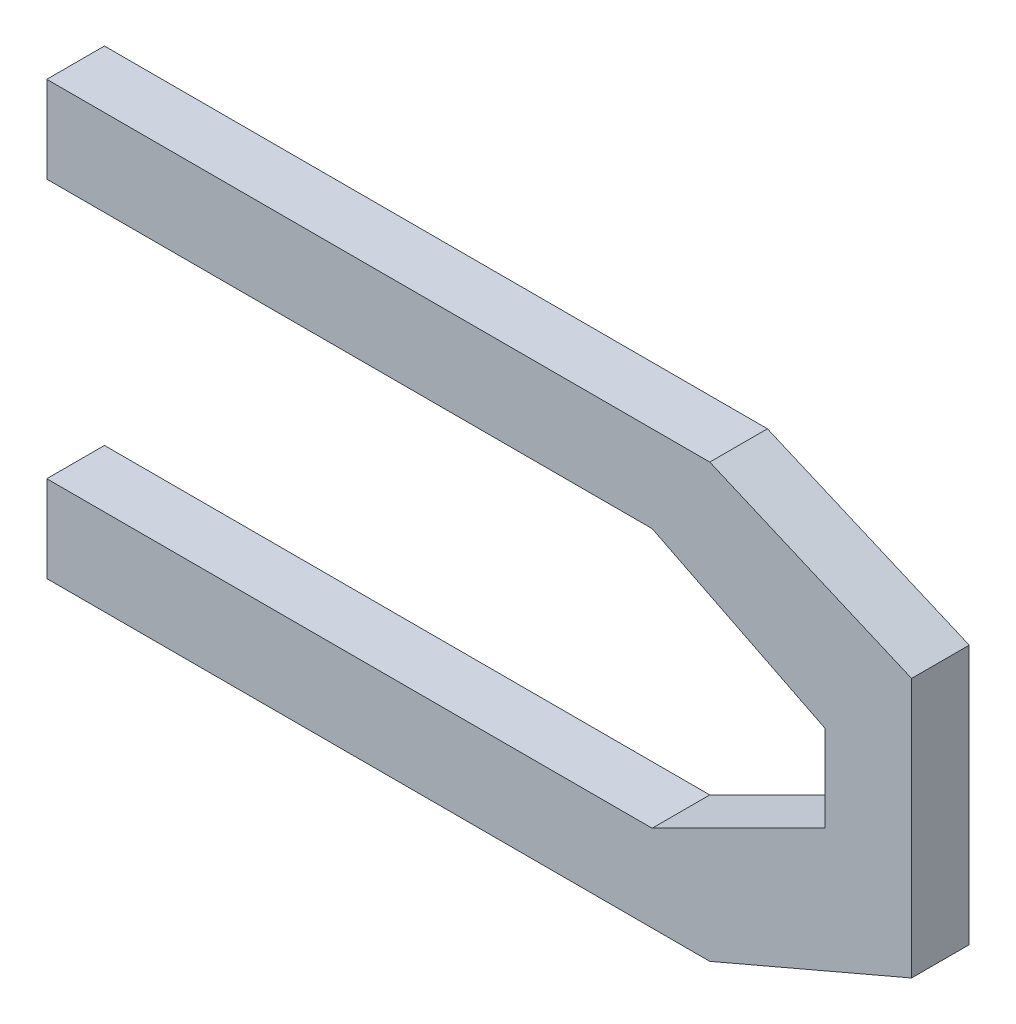
ISO-10303-21;
HEADER;
FILE_DESCRIPTION(('STEP AP214'),'2;1');
FILE_NAME('part.step','',(''),(''),'','','');
FILE_SCHEMA(('AUTOMOTIVE_DESIGN { 1 0 10303 214 1 1 1 1 }'));
ENDSEC;
DATA;
#1=APPLICATION_CONTEXT('core data for automotive mechanical design processes');
#2=APPLICATION_PROTOCOL_DEFINITION('international standard','automotive_design',2000,#1);
#3=PRODUCT_CONTEXT('',#1,'mechanical');
#4=PRODUCT('Part','Part','',(#3));
#5=PRODUCT_RELATED_PRODUCT_CATEGORY('part','',(#4));
#6=PRODUCT_DEFINITION_FORMATION('','',#4);
#7=PRODUCT_DEFINITION_CONTEXT('part definition',#1,'design');
#8=PRODUCT_DEFINITION('design','',#6,#7);
#9=PRODUCT_DEFINITION_SHAPE('','',#8);
#10=(LENGTH_UNIT() NAMED_UNIT(*) SI_UNIT(.MILLI.,.METRE.));
#11=(NAMED_UNIT(*) PLANE_ANGLE_UNIT() SI_UNIT($,.RADIAN.));
#12=(NAMED_UNIT(*) SI_UNIT($,.STERADIAN.) SOLID_ANGLE_UNIT());
#13=UNCERTAINTY_MEASURE_WITH_UNIT(LENGTH_MEASURE(1.E-05),#10,'distance_accuracy_value','');
#14=(GEOMETRIC_REPRESENTATION_CONTEXT(3) GLOBAL_UNCERTAINTY_ASSIGNED_CONTEXT((#13)) GLOBAL_UNIT_ASSIGNED_CONTEXT((#10,
#11,#12)) REPRESENTATION_CONTEXT('',''));
#15=CARTESIAN_POINT('',(0.,0.,0.));
#16=DIRECTION('',(0.,0.,1.));
#17=DIRECTION('',(1.,0.,0.));
#18=AXIS2_PLACEMENT_3D('',#15,#16,#17);
#19=CARTESIAN_POINT('',(-0.1905,-0.09525000000002,0.0254));
#20=DIRECTION('',(0.,0.,1.));
#21=DIRECTION('',(1.,0.,0.));
#22=AXIS2_PLACEMENT_3D('',#19,#20,#21);
#23=PLANE('',#22);
#24=DIRECTION('',(1.,0.,0.));
#25=VECTOR('',#24,1.);
#26=CARTESIAN_POINT('',(-0.1905,-0.05715000000001,0.0254));
#27=LINE('',#26,#25);
#28=CARTESIAN_POINT('',(-0.1905,-0.05715000000001,0.0254));
#29=VERTEX_POINT('',#28);
#30=CARTESIAN_POINT('',(0.0762,-0.05715000000001,0.0254));
#31=VERTEX_POINT('',#30);
#32=EDGE_CURVE('E157',#29,#31,#27,.T.);
#33=ORIENTED_EDGE('',*,*,#32,.F.);
#34=DIRECTION('',(0.,1.,0.));
#35=VECTOR('',#34,1.);
#36=CARTESIAN_POINT('',(-0.1905,-0.09525000000002,0.0254));
#37=LINE('',#36,#35);
#38=CARTESIAN_POINT('',(-0.1905,-0.09525000000002,0.0254));
#39=VERTEX_POINT('',#38);
#40=EDGE_CURVE('E118',#39,#29,#37,.T.);
#41=ORIENTED_EDGE('',*,*,#40,.F.);
#42=DIRECTION('',(1.,0.,0.));
#43=VECTOR('',#42,1.);
#44=CARTESIAN_POINT('',(0.1016,-0.09525000000002,0.0254));
#45=LINE('',#44,#43);
#46=CARTESIAN_POINT('',(0.101599999999998,-0.095250000000015,0.0254));
#47=VERTEX_POINT('',#46);
#48=EDGE_CURVE('E20',#47,#39,#45,.F.);
#49=ORIENTED_EDGE('',*,*,#48,.F.);
#50=DIRECTION('',(0.91914503001811,0.393919298579047,0.));
#51=VECTOR('',#50,1.);
#52=CARTESIAN_POINT('',(0.1905,-0.05715000000001,0.0254));
#53=LINE('',#52,#51);
#54=CARTESIAN_POINT('',(0.1905,-0.05715000000001,0.0254));
#55=VERTEX_POINT('',#54);
#56=EDGE_CURVE('E107',#55,#47,#53,.F.);
#57=ORIENTED_EDGE('',*,*,#56,.F.);
#58=DIRECTION('',(0.,1.,0.));
#59=VECTOR('',#58,1.);
#60=CARTESIAN_POINT('',(0.1905,0.05714999999998,0.0254));
#61=LINE('',#60,#59);
#62=CARTESIAN_POINT('',(0.190500000000002,0.057149999999985,0.0254));
#63=VERTEX_POINT('',#62);
#64=EDGE_CURVE('E102',#63,#55,#61,.F.);
#65=ORIENTED_EDGE('',*,*,#64,.F.);
#66=DIRECTION('',(-0.91914503001811,0.393919298579047,0.));
#67=VECTOR('',#66,1.);
#68=CARTESIAN_POINT('',(0.1016,0.09524999999999,0.0254));
#69=LINE('',#68,#67);
#70=CARTESIAN_POINT('',(0.1016,0.09524999999999,0.0254));
#71=VERTEX_POINT('',#70);
#72=EDGE_CURVE('E129',#71,#63,#69,.F.);
#73=ORIENTED_EDGE('',*,*,#72,.F.);
#74=DIRECTION('',(1.,0.,0.));
#75=VECTOR('',#74,1.);
#76=CARTESIAN_POINT('',(-0.1905,0.09524999999999,0.0254));
#77=LINE('',#76,#75);
#78=CARTESIAN_POINT('',(-0.1905,0.09524999999999,0.0254));
#79=VERTEX_POINT('',#78);
#80=EDGE_CURVE('E133',#79,#71,#77,.T.);
#81=ORIENTED_EDGE('',*,*,#80,.F.);
#82=DIRECTION('',(0.,1.,0.));
#83=VECTOR('',#82,1.);
#84=CARTESIAN_POINT('',(-0.1905,0.05714999999998,0.0254));
#85=LINE('',#84,#83);
#86=CARTESIAN_POINT('',(-0.1905,0.05714999999998,0.0254));
#87=VERTEX_POINT('',#86);
#88=EDGE_CURVE('E137',#87,#79,#85,.T.);
#89=ORIENTED_EDGE('',*,*,#88,.F.);
#90=DIRECTION('',(1.,0.,0.));
#91=VECTOR('',#90,1.);
#92=CARTESIAN_POINT('',(0.0762,0.05714999999998,0.0254));
#93=LINE('',#92,#91);
#94=CARTESIAN_POINT('',(0.076200000000001,0.057149999999982,0.0254));
#95=VERTEX_POINT('',#94);
#96=EDGE_CURVE('E141',#95,#87,#93,.F.);
#97=ORIENTED_EDGE('',*,*,#96,.F.);
#98=DIRECTION('',(0.894427190999916,-0.447213595499958,0.));
#99=VECTOR('',#98,1.);
#100=CARTESIAN_POINT('',(0.1524,0.01904999999999,0.0254));
#101=LINE('',#100,#99);
#102=CARTESIAN_POINT('',(0.1524,0.01904999999999,0.0254));
#103=VERTEX_POINT('',#102);
#104=EDGE_CURVE('E145',#103,#95,#101,.F.);
#105=ORIENTED_EDGE('',*,*,#104,.F.);
#106=DIRECTION('',(0.,1.,0.));
#107=VECTOR('',#106,1.);
#108=CARTESIAN_POINT('',(0.1524,-0.01905000000002,0.0254));
#109=LINE('',#108,#107);
#110=CARTESIAN_POINT('',(0.152399999999999,-0.019050000000018,0.0254));
#111=VERTEX_POINT('',#110);
#112=EDGE_CURVE('E149',#111,#103,#109,.T.);
#113=ORIENTED_EDGE('',*,*,#112,.F.);
#114=DIRECTION('',(-0.894427190999916,-0.447213595499958,0.));
#115=VECTOR('',#114,1.);
#116=CARTESIAN_POINT('',(0.0762,-0.05715000000001,0.0254));
#117=LINE('',#116,#115);
#118=EDGE_CURVE('E153',#31,#111,#117,.F.);
#119=ORIENTED_EDGE('',*,*,#118,.F.);
#120=EDGE_LOOP('',(#33,#41,#49,#57,#65,#73,#81,#89,#97,#105,#113,#119));
#121=FACE_BOUND('',#120,.T.);
#122=ADVANCED_FACE('F17',(#121),#23,.T.);
#123=CARTESIAN_POINT('',(0.1016,-0.09525000000002,0.));
#124=DIRECTION('',(0.,-1.,0.));
#125=DIRECTION('',(0.,0.,-1.));
#126=AXIS2_PLACEMENT_3D('',#123,#124,#125);
#127=PLANE('',#126);
#128=DIRECTION('',(0.,0.,1.));
#129=VECTOR('',#128,1.);
#130=CARTESIAN_POINT('',(-0.1905,-0.09525000000002,0.));
#131=LINE('',#130,#129);
#132=CARTESIAN_POINT('',(-0.1905,-0.09525000000002,0.));
#133=VERTEX_POINT('',#132);
#134=EDGE_CURVE('E161',#133,#39,#131,.T.);
#135=ORIENTED_EDGE('',*,*,#134,.F.);
#136=DIRECTION('',(1.,0.,0.));
#137=VECTOR('',#136,1.);
#138=CARTESIAN_POINT('',(-0.1905,-0.09525000000002,0.));
#139=LINE('',#138,#137);
#140=CARTESIAN_POINT('',(0.101599999999998,-0.095250000000015,0.));
#141=VERTEX_POINT('',#140);
#142=EDGE_CURVE('E124',#133,#141,#139,.T.);
#143=ORIENTED_EDGE('',*,*,#142,.T.);
#144=DIRECTION('',(0.,0.,1.));
#145=VECTOR('',#144,1.);
#146=CARTESIAN_POINT('',(0.101599999999991,-0.0952499999999999,0.));
#147=LINE('',#146,#145);
#148=EDGE_CURVE('E112',#47,#141,#147,.F.);
#149=ORIENTED_EDGE('',*,*,#148,.F.);
#150=ORIENTED_EDGE('',*,*,#48,.T.);
#151=EDGE_LOOP('',(#135,#143,#149,#150));
#152=FACE_BOUND('',#151,.T.);
#153=ADVANCED_FACE('F123',(#152),#127,.T.);
#154=CARTESIAN_POINT('',(0.1905,-0.05715000000001,0.));
#155=DIRECTION('',(0.393919298579047,-0.91914503001811,0.));
#156=DIRECTION('',(0.91914503001811,0.393919298579047,0.));
#157=AXIS2_PLACEMENT_3D('',#154,#155,#156);
#158=PLANE('',#157);
#159=ORIENTED_EDGE('',*,*,#148,.T.);
#160=DIRECTION('',(0.919145030018021,0.393919298579255,0.));
#161=VECTOR('',#160,1.);
#162=CARTESIAN_POINT('',(0.1016,-0.09525000000002,0.));
#163=LINE('',#162,#161);
#164=CARTESIAN_POINT('',(0.1905,-0.05715000000001,0.));
#165=VERTEX_POINT('',#164);
#166=EDGE_CURVE('E166',#141,#165,#163,.T.);
#167=ORIENTED_EDGE('',*,*,#166,.T.);
#168=DIRECTION('',(0.,0.,-1.));
#169=VECTOR('',#168,1.);
#170=CARTESIAN_POINT('',(0.1905,-0.05715000000001,0.));
#171=LINE('',#170,#169);
#172=EDGE_CURVE('E114',#55,#165,#171,.T.);
#173=ORIENTED_EDGE('',*,*,#172,.F.);
#174=ORIENTED_EDGE('',*,*,#56,.T.);
#175=EDGE_LOOP('',(#159,#167,#173,#174));
#176=FACE_BOUND('',#175,.T.);
#177=ADVANCED_FACE('F109',(#176),#158,.T.);
#178=CARTESIAN_POINT('',(0.1905,0.05714999999998,0.));
#179=DIRECTION('',(1.,0.,0.));
#180=DIRECTION('',(0.,0.,-1.));
#181=AXIS2_PLACEMENT_3D('',#178,#179,#180);
#182=PLANE('',#181);
#183=ORIENTED_EDGE('',*,*,#172,.T.);
#184=DIRECTION('',(0.,1.,0.));
#185=VECTOR('',#184,1.);
#186=CARTESIAN_POINT('',(0.1905,-0.09525000000002,0.));
#187=LINE('',#186,#185);
#188=CARTESIAN_POINT('',(0.190500000000002,0.057149999999985,0.));
#189=VERTEX_POINT('',#188);
#190=EDGE_CURVE('E168',#165,#189,#187,.T.);
#191=ORIENTED_EDGE('',*,*,#190,.T.);
#192=DIRECTION('',(0.,0.,1.));
#193=VECTOR('',#192,1.);
#194=CARTESIAN_POINT('',(0.190500000000009,0.0571500000000001,0.));
#195=LINE('',#194,#193);
#196=EDGE_CURVE('E131',#63,#189,#195,.F.);
#197=ORIENTED_EDGE('',*,*,#196,.F.);
#198=ORIENTED_EDGE('',*,*,#64,.T.);
#199=EDGE_LOOP('',(#183,#191,#197,#198));
#200=FACE_BOUND('',#199,.T.);
#201=ADVANCED_FACE('F234',(#200),#182,.T.);
#202=CARTESIAN_POINT('',(0.1016,0.09524999999999,0.));
#203=DIRECTION('',(0.393919298579047,0.91914503001811,0.));
#204=DIRECTION('',(-0.91914503001811,0.393919298579047,0.));
#205=AXIS2_PLACEMENT_3D('',#202,#203,#204);
#206=PLANE('',#205);
#207=ORIENTED_EDGE('',*,*,#196,.T.);
#208=DIRECTION('',(-0.919145030018021,0.393919298579255,0.));
#209=VECTOR('',#208,1.);
#210=CARTESIAN_POINT('',(0.1905,0.05714999999998,0.));
#211=LINE('',#210,#209);
#212=CARTESIAN_POINT('',(0.1016,0.09524999999999,0.));
#213=VERTEX_POINT('',#212);
#214=EDGE_CURVE('E171',#189,#213,#211,.T.);
#215=ORIENTED_EDGE('',*,*,#214,.T.);
#216=DIRECTION('',(0.,0.,1.));
#217=VECTOR('',#216,1.);
#218=CARTESIAN_POINT('',(0.1016,0.09524999999999,0.));
#219=LINE('',#218,#217);
#220=EDGE_CURVE('E135',#71,#213,#219,.F.);
#221=ORIENTED_EDGE('',*,*,#220,.F.);
#222=ORIENTED_EDGE('',*,*,#72,.T.);
#223=EDGE_LOOP('',(#207,#215,#221,#222));
#224=FACE_BOUND('',#223,.T.);
#225=ADVANCED_FACE('F233',(#224),#206,.T.);
#226=CARTESIAN_POINT('',(-0.1905,0.09524999999999,0.));
#227=DIRECTION('',(0.,1.,0.));
#228=DIRECTION('',(0.,0.,1.));
#229=AXIS2_PLACEMENT_3D('',#226,#227,#228);
#230=PLANE('',#229);
#231=ORIENTED_EDGE('',*,*,#220,.T.);
#232=DIRECTION('',(1.,0.,0.));
#233=VECTOR('',#232,1.);
#234=CARTESIAN_POINT('',(-0.1905,0.09524999999999,0.));
#235=LINE('',#234,#233);
#236=CARTESIAN_POINT('',(-0.1905,0.09524999999999,0.));
#237=VERTEX_POINT('',#236);
#238=EDGE_CURVE('E174',#213,#237,#235,.F.);
#239=ORIENTED_EDGE('',*,*,#238,.T.);
#240=DIRECTION('',(0.,0.,1.));
#241=VECTOR('',#240,1.);
#242=CARTESIAN_POINT('',(-0.1905,0.09524999999999,0.));
#243=LINE('',#242,#241);
#244=EDGE_CURVE('E139',#79,#237,#243,.F.);
#245=ORIENTED_EDGE('',*,*,#244,.F.);
#246=ORIENTED_EDGE('',*,*,#80,.T.);
#247=EDGE_LOOP('',(#231,#239,#245,#246));
#248=FACE_BOUND('',#247,.T.);
#249=ADVANCED_FACE('F227',(#248),#230,.T.);
#250=CARTESIAN_POINT('',(-0.1905,0.05714999999998,0.));
#251=DIRECTION('',(-1.,0.,0.));
#252=DIRECTION('',(0.,0.,1.));
#253=AXIS2_PLACEMENT_3D('',#250,#251,#252);
#254=PLANE('',#253);
#255=ORIENTED_EDGE('',*,*,#244,.T.);
#256=DIRECTION('',(0.,1.,0.));
#257=VECTOR('',#256,1.);
#258=CARTESIAN_POINT('',(-0.1905,-0.09525000000002,0.));
#259=LINE('',#258,#257);
#260=CARTESIAN_POINT('',(-0.1905,0.05714999999998,0.));
#261=VERTEX_POINT('',#260);
#262=EDGE_CURVE('E177',#237,#261,#259,.F.);
#263=ORIENTED_EDGE('',*,*,#262,.T.);
#264=DIRECTION('',(0.,0.,-1.));
#265=VECTOR('',#264,1.);
#266=CARTESIAN_POINT('',(-0.1905,0.05714999999998,0.));
#267=LINE('',#266,#265);
#268=EDGE_CURVE('E143',#87,#261,#267,.T.);
#269=ORIENTED_EDGE('',*,*,#268,.F.);
#270=ORIENTED_EDGE('',*,*,#88,.T.);
#271=EDGE_LOOP('',(#255,#263,#269,#270));
#272=FACE_BOUND('',#271,.T.);
#273=ADVANCED_FACE('F223',(#272),#254,.T.);
#274=CARTESIAN_POINT('',(0.0762,0.05714999999998,0.));
#275=DIRECTION('',(0.,-1.,0.));
#276=DIRECTION('',(0.,0.,-1.));
#277=AXIS2_PLACEMENT_3D('',#274,#275,#276);
#278=PLANE('',#277);
#279=ORIENTED_EDGE('',*,*,#268,.T.);
#280=DIRECTION('',(1.,0.,0.));
#281=VECTOR('',#280,1.);
#282=CARTESIAN_POINT('',(-0.1905,0.05714999999998,0.));
#283=LINE('',#282,#281);
#284=CARTESIAN_POINT('',(0.076200000000001,0.057149999999982,0.));
#285=VERTEX_POINT('',#284);
#286=EDGE_CURVE('E180',#261,#285,#283,.T.);
#287=ORIENTED_EDGE('',*,*,#286,.T.);
#288=DIRECTION('',(0.,0.,1.));
#289=VECTOR('',#288,1.);
#290=CARTESIAN_POINT('',(0.076200000000004,0.057149999999988,0.));
#291=LINE('',#290,#289);
#292=EDGE_CURVE('E147',#95,#285,#291,.F.);
#293=ORIENTED_EDGE('',*,*,#292,.F.);
#294=ORIENTED_EDGE('',*,*,#96,.T.);
#295=EDGE_LOOP('',(#279,#287,#293,#294));
#296=FACE_BOUND('',#295,.T.);
#297=ADVANCED_FACE('F217',(#296),#278,.T.);
#298=CARTESIAN_POINT('',(0.1524,0.01904999999999,0.));
#299=DIRECTION('',(-0.447213595499958,-0.894427190999916,0.));
#300=DIRECTION('',(0.894427190999916,-0.447213595499958,0.));
#301=AXIS2_PLACEMENT_3D('',#298,#299,#300);
#302=PLANE('',#301);
#303=ORIENTED_EDGE('',*,*,#292,.T.);
#304=DIRECTION('',(0.894427190999963,-0.447213595499864,0.));
#305=VECTOR('',#304,1.);
#306=CARTESIAN_POINT('',(0.0762,0.05714999999998,0.));
#307=LINE('',#306,#305);
#308=CARTESIAN_POINT('',(0.1524,0.01904999999999,0.));
#309=VERTEX_POINT('',#308);
#310=EDGE_CURVE('E183',#285,#309,#307,.T.);
#311=ORIENTED_EDGE('',*,*,#310,.T.);
#312=DIRECTION('',(0.,0.,1.));
#313=VECTOR('',#312,1.);
#314=CARTESIAN_POINT('',(0.1524,0.01904999999999,0.));
#315=LINE('',#314,#313);
#316=EDGE_CURVE('E151',#103,#309,#315,.F.);
#317=ORIENTED_EDGE('',*,*,#316,.F.);
#318=ORIENTED_EDGE('',*,*,#104,.T.);
#319=EDGE_LOOP('',(#303,#311,#317,#318));
#320=FACE_BOUND('',#319,.T.);
#321=ADVANCED_FACE('F213',(#320),#302,.T.);
#322=CARTESIAN_POINT('',(0.1524,-0.01905000000002,0.));
#323=DIRECTION('',(-1.,0.,0.));
#324=DIRECTION('',(0.,0.,1.));
#325=AXIS2_PLACEMENT_3D('',#322,#323,#324);
#326=PLANE('',#325);
#327=ORIENTED_EDGE('',*,*,#316,.T.);
#328=DIRECTION('',(0.,1.,0.));
#329=VECTOR('',#328,1.);
#330=CARTESIAN_POINT('',(0.1524,-0.09525000000002,0.));
#331=LINE('',#330,#329);
#332=CARTESIAN_POINT('',(0.152399999999999,-0.019050000000018,0.));
#333=VERTEX_POINT('',#332);
#334=EDGE_CURVE('E186',#309,#333,#331,.F.);
#335=ORIENTED_EDGE('',*,*,#334,.T.);
#336=DIRECTION('',(0.,0.,1.));
#337=VECTOR('',#336,1.);
#338=CARTESIAN_POINT('',(0.152399999999996,-0.019050000000012,0.));
#339=LINE('',#338,#337);
#340=EDGE_CURVE('E155',#111,#333,#339,.F.);
#341=ORIENTED_EDGE('',*,*,#340,.F.);
#342=ORIENTED_EDGE('',*,*,#112,.T.);
#343=EDGE_LOOP('',(#327,#335,#341,#342));
#344=FACE_BOUND('',#343,.T.);
#345=ADVANCED_FACE('F207',(#344),#326,.T.);
#346=CARTESIAN_POINT('',(0.0762,-0.05715000000001,0.));
#347=DIRECTION('',(-0.447213595499958,0.894427190999916,0.));
#348=DIRECTION('',(-0.894427190999916,-0.447213595499958,0.));
#349=AXIS2_PLACEMENT_3D('',#346,#347,#348);
#350=PLANE('',#349);
#351=ORIENTED_EDGE('',*,*,#340,.T.);
#352=DIRECTION('',(-0.894427190999963,-0.447213595499864,0.));
#353=VECTOR('',#352,1.);
#354=CARTESIAN_POINT('',(0.1524,-0.01905000000002,0.));
#355=LINE('',#354,#353);
#356=CARTESIAN_POINT('',(0.0762,-0.05715000000001,0.));
#357=VERTEX_POINT('',#356);
#358=EDGE_CURVE('E189',#333,#357,#355,.T.);
#359=ORIENTED_EDGE('',*,*,#358,.T.);
#360=DIRECTION('',(0.,0.,1.));
#361=VECTOR('',#360,1.);
#362=CARTESIAN_POINT('',(0.0762,-0.05715000000001,0.));
#363=LINE('',#362,#361);
#364=EDGE_CURVE('E159',#31,#357,#363,.F.);
#365=ORIENTED_EDGE('',*,*,#364,.F.);
#366=ORIENTED_EDGE('',*,*,#118,.T.);
#367=EDGE_LOOP('',(#351,#359,#365,#366));
#368=FACE_BOUND('',#367,.T.);
#369=ADVANCED_FACE('F202',(#368),#350,.T.);
#370=CARTESIAN_POINT('',(-0.1905,-0.05715000000001,0.));
#371=DIRECTION('',(0.,1.,0.));
#372=DIRECTION('',(0.,0.,1.));
#373=AXIS2_PLACEMENT_3D('',#370,#371,#372);
#374=PLANE('',#373);
#375=ORIENTED_EDGE('',*,*,#364,.T.);
#376=DIRECTION('',(1.,0.,0.));
#377=VECTOR('',#376,1.);
#378=CARTESIAN_POINT('',(-0.1905,-0.05715000000001,0.));
#379=LINE('',#378,#377);
#380=CARTESIAN_POINT('',(-0.1905,-0.05715000000001,0.));
#381=VERTEX_POINT('',#380);
#382=EDGE_CURVE('E26',#357,#381,#379,.F.);
#383=ORIENTED_EDGE('',*,*,#382,.T.);
#384=DIRECTION('',(0.,0.,1.));
#385=VECTOR('',#384,1.);
#386=CARTESIAN_POINT('',(-0.1905,-0.05715000000001,0.));
#387=LINE('',#386,#385);
#388=EDGE_CURVE('E34',#29,#381,#387,.F.);
#389=ORIENTED_EDGE('',*,*,#388,.F.);
#390=ORIENTED_EDGE('',*,*,#32,.T.);
#391=EDGE_LOOP('',(#375,#383,#389,#390));
#392=FACE_BOUND('',#391,.T.);
#393=ADVANCED_FACE('F195',(#392),#374,.T.);
#394=CARTESIAN_POINT('',(-0.1905,-0.09525000000002,0.));
#395=DIRECTION('',(-1.,0.,0.));
#396=DIRECTION('',(0.,0.,1.));
#397=AXIS2_PLACEMENT_3D('',#394,#395,#396);
#398=PLANE('',#397);
#399=ORIENTED_EDGE('',*,*,#388,.T.);
#400=DIRECTION('',(0.,1.,0.));
#401=VECTOR('',#400,1.);
#402=CARTESIAN_POINT('',(-0.1905,-0.09525000000002,0.));
#403=LINE('',#402,#401);
#404=EDGE_CURVE('E11',#381,#133,#403,.F.);
#405=ORIENTED_EDGE('',*,*,#404,.T.);
#406=ORIENTED_EDGE('',*,*,#134,.T.);
#407=ORIENTED_EDGE('',*,*,#40,.T.);
#408=EDGE_LOOP('',(#399,#405,#406,#407));
#409=FACE_BOUND('',#408,.T.);
#410=ADVANCED_FACE('F235',(#409),#398,.T.);
#411=CARTESIAN_POINT('',(-0.1905,-0.09525000000002,0.));
#412=DIRECTION('',(0.,0.,1.));
#413=DIRECTION('',(1.,0.,0.));
#414=AXIS2_PLACEMENT_3D('',#411,#412,#413);
#415=PLANE('',#414);
#416=ORIENTED_EDGE('',*,*,#382,.F.);
#417=ORIENTED_EDGE('',*,*,#358,.F.);
#418=ORIENTED_EDGE('',*,*,#334,.F.);
#419=ORIENTED_EDGE('',*,*,#310,.F.);
#420=ORIENTED_EDGE('',*,*,#286,.F.);
#421=ORIENTED_EDGE('',*,*,#262,.F.);
#422=ORIENTED_EDGE('',*,*,#238,.F.);
#423=ORIENTED_EDGE('',*,*,#214,.F.);
#424=ORIENTED_EDGE('',*,*,#190,.F.);
#425=ORIENTED_EDGE('',*,*,#166,.F.);
#426=ORIENTED_EDGE('',*,*,#142,.F.);
#427=ORIENTED_EDGE('',*,*,#404,.F.);
#428=EDGE_LOOP('',(#416,#417,#418,#419,#420,#421,#422,#423,#424,#425,#426,#427));
#429=FACE_BOUND('',#428,.T.);
#430=ADVANCED_FACE('F199',(#429),#415,.F.);
#431=CLOSED_SHELL('',(#122,#153,#177,#201,#225,#249,#273,#297,#321,#345,#369,#393,#410,#430));
#432=MANIFOLD_SOLID_BREP('B1',#431);
#433=ADVANCED_BREP_SHAPE_REPRESENTATION('',(#18,#432),#14);
#434=SHAPE_DEFINITION_REPRESENTATION(#9,#433);
ENDSEC;
END-ISO-10303-21;
